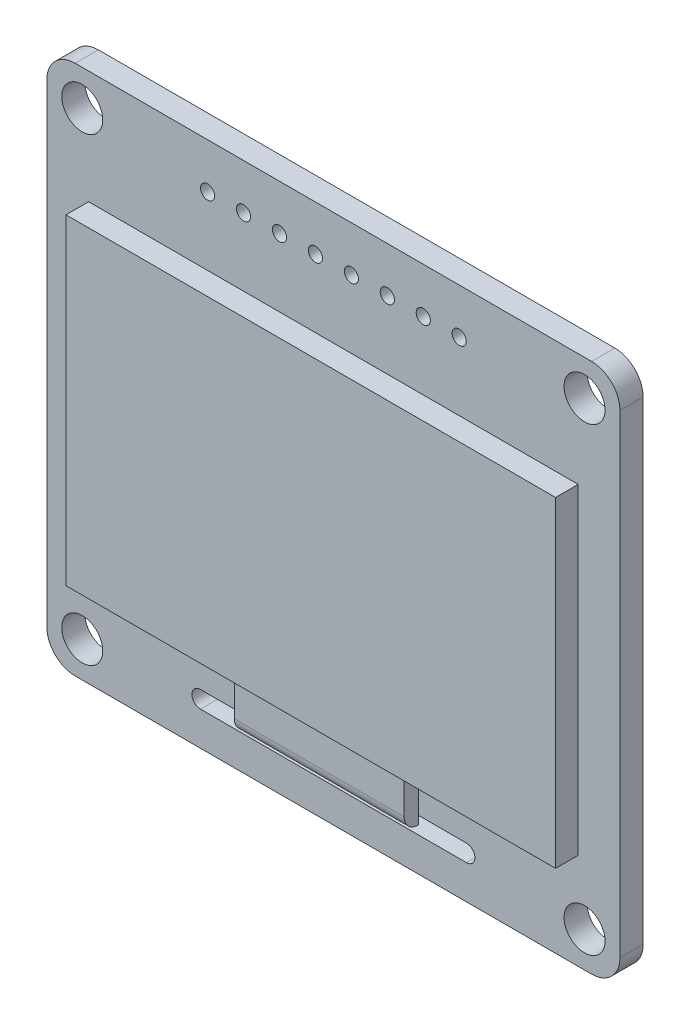
ISO-10303-21;
HEADER;
FILE_DESCRIPTION(('STEP AP214'),'2;1');
FILE_NAME('part.step','',(''),(''),'','','');
FILE_SCHEMA(('AUTOMOTIVE_DESIGN { 1 0 10303 214 1 1 1 1 }'));
ENDSEC;
DATA;
#1=APPLICATION_CONTEXT('core data for automotive mechanical design processes');
#2=APPLICATION_PROTOCOL_DEFINITION('international standard','automotive_design',2000,#1);
#3=PRODUCT_CONTEXT('',#1,'mechanical');
#4=PRODUCT('Part','Part','',(#3));
#5=PRODUCT_RELATED_PRODUCT_CATEGORY('part','',(#4));
#6=PRODUCT_DEFINITION_FORMATION('','',#4);
#7=PRODUCT_DEFINITION_CONTEXT('part definition',#1,'design');
#8=PRODUCT_DEFINITION('design','',#6,#7);
#9=PRODUCT_DEFINITION_SHAPE('','',#8);
#10=(LENGTH_UNIT() NAMED_UNIT(*) SI_UNIT(.MILLI.,.METRE.));
#11=(NAMED_UNIT(*) PLANE_ANGLE_UNIT() SI_UNIT($,.RADIAN.));
#12=(NAMED_UNIT(*) SI_UNIT($,.STERADIAN.) SOLID_ANGLE_UNIT());
#13=UNCERTAINTY_MEASURE_WITH_UNIT(LENGTH_MEASURE(1.E-05),#10,'distance_accuracy_value','');
#14=(GEOMETRIC_REPRESENTATION_CONTEXT(3) GLOBAL_UNCERTAINTY_ASSIGNED_CONTEXT((#13)) GLOBAL_UNIT_ASSIGNED_CONTEXT((#10,
#11,#12)) REPRESENTATION_CONTEXT('',''));
#15=CARTESIAN_POINT('',(0.,0.,0.));
#16=DIRECTION('',(0.,0.,1.));
#17=DIRECTION('',(1.,0.,0.));
#18=AXIS2_PLACEMENT_3D('',#15,#16,#17);
#19=CARTESIAN_POINT('',(0.,0.,1.64));
#20=DIRECTION('',(0.,0.,1.));
#21=DIRECTION('',(1.,0.,0.));
#22=AXIS2_PLACEMENT_3D('',#19,#20,#21);
#23=PLANE('',#22);
#24=CARTESIAN_POINT('',(-6.35,15.55,1.64));
#25=DIRECTION('',(0.,0.,1.));
#26=DIRECTION('',(1.,0.,0.));
#27=AXIS2_PLACEMENT_3D('',#24,#25,#26);
#28=CIRCLE('',#27,0.500000000000001);
#29=CARTESIAN_POINT('',(-5.85,15.55,1.64));
#30=VERTEX_POINT('',#29);
#31=EDGE_CURVE('E232',#30,#30,#28,.T.);
#32=ORIENTED_EDGE('',*,*,#31,.F.);
#33=EDGE_LOOP('',(#32));
#34=FACE_BOUND('',#33,.T.);
#35=CARTESIAN_POINT('',(-3.81,15.55,1.64));
#36=DIRECTION('',(0.,0.,1.));
#37=DIRECTION('',(1.,0.,0.));
#38=AXIS2_PLACEMENT_3D('',#35,#36,#37);
#39=CIRCLE('',#38,0.5);
#40=CARTESIAN_POINT('',(-3.31,15.55,1.64));
#41=VERTEX_POINT('',#40);
#42=EDGE_CURVE('E240',#41,#41,#39,.T.);
#43=ORIENTED_EDGE('',*,*,#42,.F.);
#44=EDGE_LOOP('',(#43));
#45=FACE_BOUND('',#44,.T.);
#46=CARTESIAN_POINT('',(-1.27,15.55,1.64));
#47=DIRECTION('',(0.,0.,1.));
#48=DIRECTION('',(1.,0.,0.));
#49=AXIS2_PLACEMENT_3D('',#46,#47,#48);
#50=CIRCLE('',#49,0.5);
#51=CARTESIAN_POINT('',(-0.77,15.55,1.64));
#52=VERTEX_POINT('',#51);
#53=EDGE_CURVE('E246',#52,#52,#50,.T.);
#54=ORIENTED_EDGE('',*,*,#53,.F.);
#55=EDGE_LOOP('',(#54));
#56=FACE_BOUND('',#55,.T.);
#57=CARTESIAN_POINT('',(1.27,15.55,1.64));
#58=DIRECTION('',(0.,0.,1.));
#59=DIRECTION('',(1.,0.,0.));
#60=AXIS2_PLACEMENT_3D('',#57,#58,#59);
#61=CIRCLE('',#60,0.500000000000001);
#62=CARTESIAN_POINT('',(1.77,15.55,1.64));
#63=VERTEX_POINT('',#62);
#64=EDGE_CURVE('E252',#63,#63,#61,.T.);
#65=ORIENTED_EDGE('',*,*,#64,.F.);
#66=EDGE_LOOP('',(#65));
#67=FACE_BOUND('',#66,.T.);
#68=CARTESIAN_POINT('',(3.81,15.55,1.64));
#69=DIRECTION('',(0.,0.,1.));
#70=DIRECTION('',(1.,0.,0.));
#71=AXIS2_PLACEMENT_3D('',#68,#69,#70);
#72=CIRCLE('',#71,0.500000000000001);
#73=CARTESIAN_POINT('',(4.31,15.55,1.64));
#74=VERTEX_POINT('',#73);
#75=EDGE_CURVE('E258',#74,#74,#72,.T.);
#76=ORIENTED_EDGE('',*,*,#75,.F.);
#77=EDGE_LOOP('',(#76));
#78=FACE_BOUND('',#77,.T.);
#79=CARTESIAN_POINT('',(6.35,15.55,1.64));
#80=DIRECTION('',(0.,0.,1.));
#81=DIRECTION('',(1.,0.,0.));
#82=AXIS2_PLACEMENT_3D('',#79,#80,#81);
#83=CIRCLE('',#82,0.500000000000001);
#84=CARTESIAN_POINT('',(6.85,15.55,1.64));
#85=VERTEX_POINT('',#84);
#86=EDGE_CURVE('E264',#85,#85,#83,.T.);
#87=ORIENTED_EDGE('',*,*,#86,.F.);
#88=EDGE_LOOP('',(#87));
#89=FACE_BOUND('',#88,.T.);
#90=CARTESIAN_POINT('',(8.89,15.55,1.64));
#91=DIRECTION('',(0.,0.,1.));
#92=DIRECTION('',(1.,0.,0.));
#93=AXIS2_PLACEMENT_3D('',#90,#91,#92);
#94=CIRCLE('',#93,0.499999999999999);
#95=CARTESIAN_POINT('',(9.39,15.55,1.64));
#96=VERTEX_POINT('',#95);
#97=EDGE_CURVE('E231',#96,#96,#94,.T.);
#98=ORIENTED_EDGE('',*,*,#97,.F.);
#99=EDGE_LOOP('',(#98));
#100=FACE_BOUND('',#99,.T.);
#101=CARTESIAN_POINT('',(-8.89,15.55,1.64));
#102=DIRECTION('',(0.,0.,1.));
#103=DIRECTION('',(1.,0.,0.));
#104=AXIS2_PLACEMENT_3D('',#101,#102,#103);
#105=CIRCLE('',#104,0.500000000000001);
#106=CARTESIAN_POINT('',(-8.39,15.55,1.64));
#107=VERTEX_POINT('',#106);
#108=EDGE_CURVE('E239',#107,#107,#105,.T.);
#109=ORIENTED_EDGE('',*,*,#108,.F.);
#110=EDGE_LOOP('',(#109));
#111=FACE_BOUND('',#110,.T.);
#112=CARTESIAN_POINT('',(17.75,16.25,1.64));
#113=DIRECTION('',(0.,0.,1.));
#114=DIRECTION('',(1.,0.,0.));
#115=AXIS2_PLACEMENT_3D('',#112,#113,#114);
#116=CIRCLE('',#115,1.45);
#117=CARTESIAN_POINT('',(19.2,16.25,1.64));
#118=VERTEX_POINT('',#117);
#119=EDGE_CURVE('E313',#118,#118,#116,.T.);
#120=ORIENTED_EDGE('',*,*,#119,.F.);
#121=EDGE_LOOP('',(#120));
#122=FACE_BOUND('',#121,.T.);
#123=CARTESIAN_POINT('',(17.7500000000003,-16.25,1.64));
#124=DIRECTION('',(0.,0.,1.));
#125=DIRECTION('',(1.,0.,0.));
#126=AXIS2_PLACEMENT_3D('',#123,#124,#125);
#127=CIRCLE('',#126,1.45);
#128=CARTESIAN_POINT('',(19.2000000000003,-16.25,1.64));
#129=VERTEX_POINT('',#128);
#130=EDGE_CURVE('E321',#129,#129,#127,.T.);
#131=ORIENTED_EDGE('',*,*,#130,.F.);
#132=EDGE_LOOP('',(#131));
#133=FACE_BOUND('',#132,.T.);
#134=CARTESIAN_POINT('',(-17.7499999999997,-16.25,1.64));
#135=DIRECTION('',(0.,0.,1.));
#136=DIRECTION('',(1.,0.,0.));
#137=AXIS2_PLACEMENT_3D('',#134,#135,#136);
#138=CIRCLE('',#137,1.45);
#139=CARTESIAN_POINT('',(-16.2999999999997,-16.25,1.64));
#140=VERTEX_POINT('',#139);
#141=EDGE_CURVE('E312',#140,#140,#138,.T.);
#142=ORIENTED_EDGE('',*,*,#141,.F.);
#143=EDGE_LOOP('',(#142));
#144=FACE_BOUND('',#143,.T.);
#145=CARTESIAN_POINT('',(-17.75,16.25,1.64));
#146=DIRECTION('',(0.,0.,1.));
#147=DIRECTION('',(1.,0.,0.));
#148=AXIS2_PLACEMENT_3D('',#145,#146,#147);
#149=CIRCLE('',#148,1.45);
#150=CARTESIAN_POINT('',(-16.3,16.25,1.64));
#151=VERTEX_POINT('',#150);
#152=EDGE_CURVE('E320',#151,#151,#149,.T.);
#153=ORIENTED_EDGE('',*,*,#152,.F.);
#154=EDGE_LOOP('',(#153));
#155=FACE_BOUND('',#154,.T.);
#156=DIRECTION('',(0.,-1.,0.));
#157=VECTOR('',#156,1.);
#158=CARTESIAN_POINT('',(-20.25,18.75,1.64));
#159=LINE('',#158,#157);
#160=CARTESIAN_POINT('',(-20.25,16.75,1.64));
#161=VERTEX_POINT('',#160);
#162=CARTESIAN_POINT('',(-20.25,-16.75,1.64));
#163=VERTEX_POINT('',#162);
#164=EDGE_CURVE('E337',#161,#163,#159,.T.);
#165=ORIENTED_EDGE('',*,*,#164,.T.);
#166=CARTESIAN_POINT('',(-18.25,-16.75,1.64));
#167=DIRECTION('',(0.,0.,1.));
#168=DIRECTION('',(1.,0.,0.));
#169=AXIS2_PLACEMENT_3D('',#166,#167,#168);
#170=CIRCLE('',#169,2.);
#171=CARTESIAN_POINT('',(-18.25,-18.75,1.64));
#172=VERTEX_POINT('',#171);
#173=EDGE_CURVE('E384',#163,#172,#170,.T.);
#174=ORIENTED_EDGE('',*,*,#173,.T.);
#175=DIRECTION('',(1.,0.,0.));
#176=VECTOR('',#175,1.);
#177=CARTESIAN_POINT('',(-20.25,-18.75,1.64));
#178=LINE('',#177,#176);
#179=CARTESIAN_POINT('',(18.25,-18.75,1.64));
#180=VERTEX_POINT('',#179);
#181=EDGE_CURVE('E340',#172,#180,#178,.T.);
#182=ORIENTED_EDGE('',*,*,#181,.T.);
#183=CARTESIAN_POINT('',(18.25,-16.75,1.64));
#184=DIRECTION('',(0.,0.,1.));
#185=DIRECTION('',(1.,0.,0.));
#186=AXIS2_PLACEMENT_3D('',#183,#184,#185);
#187=CIRCLE('',#186,2.);
#188=CARTESIAN_POINT('',(20.25,-16.75,1.64));
#189=VERTEX_POINT('',#188);
#190=EDGE_CURVE('E382',#180,#189,#187,.T.);
#191=ORIENTED_EDGE('',*,*,#190,.T.);
#192=DIRECTION('',(0.,1.,0.));
#193=VECTOR('',#192,1.);
#194=CARTESIAN_POINT('',(20.25,18.75,1.64));
#195=LINE('',#194,#193);
#196=CARTESIAN_POINT('',(20.25,16.75,1.64));
#197=VERTEX_POINT('',#196);
#198=EDGE_CURVE('E344',#189,#197,#195,.T.);
#199=ORIENTED_EDGE('',*,*,#198,.T.);
#200=CARTESIAN_POINT('',(18.25,16.75,1.64));
#201=DIRECTION('',(0.,0.,1.));
#202=DIRECTION('',(1.,0.,0.));
#203=AXIS2_PLACEMENT_3D('',#200,#201,#202);
#204=CIRCLE('',#203,2.);
#205=CARTESIAN_POINT('',(18.25,18.75,1.64));
#206=VERTEX_POINT('',#205);
#207=EDGE_CURVE('E380',#197,#206,#204,.T.);
#208=ORIENTED_EDGE('',*,*,#207,.T.);
#209=DIRECTION('',(-1.,0.,0.));
#210=VECTOR('',#209,1.);
#211=CARTESIAN_POINT('',(-20.25,18.75,1.64));
#212=LINE('',#211,#210);
#213=CARTESIAN_POINT('',(-18.25,18.75,1.64));
#214=VERTEX_POINT('',#213);
#215=EDGE_CURVE('E347',#206,#214,#212,.T.);
#216=ORIENTED_EDGE('',*,*,#215,.T.);
#217=CARTESIAN_POINT('',(-18.25,16.75,1.64));
#218=DIRECTION('',(0.,0.,1.));
#219=DIRECTION('',(1.,0.,0.));
#220=AXIS2_PLACEMENT_3D('',#217,#218,#219);
#221=CIRCLE('',#220,2.);
#222=EDGE_CURVE('E378',#214,#161,#221,.T.);
#223=ORIENTED_EDGE('',*,*,#222,.T.);
#224=EDGE_LOOP('',(#165,#174,#182,#191,#199,#208,#216,#223));
#225=FACE_BOUND('',#224,.T.);
#226=DIRECTION('',(-1.,0.,0.));
#227=VECTOR('',#226,1.);
#228=CARTESIAN_POINT('',(-9.4,-15.15,1.64));
#229=LINE('',#228,#227);
#230=CARTESIAN_POINT('',(-6.,-15.15,1.64));
#231=VERTEX_POINT('',#230);
#232=CARTESIAN_POINT('',(-9.4,-15.15,1.64));
#233=VERTEX_POINT('',#232);
#234=EDGE_CURVE('E295',#231,#233,#229,.T.);
#235=ORIENTED_EDGE('',*,*,#234,.F.);
#236=DIRECTION('',(0.,-1.,0.));
#237=VECTOR('',#236,1.);
#238=CARTESIAN_POINT('',(-6.,-11.95,1.64));
#239=LINE('',#238,#237);
#240=CARTESIAN_POINT('',(-6.,-11.95,1.64));
#241=VERTEX_POINT('',#240);
#242=EDGE_CURVE('E408',#241,#231,#239,.T.);
#243=ORIENTED_EDGE('',*,*,#242,.F.);
#244=DIRECTION('',(1.,0.,0.));
#245=VECTOR('',#244,1.);
#246=CARTESIAN_POINT('',(-17.3,-11.95,1.64));
#247=LINE('',#246,#245);
#248=CARTESIAN_POINT('',(-17.3,-11.95,1.64));
#249=VERTEX_POINT('',#248);
#250=EDGE_CURVE('E193',#249,#241,#247,.T.);
#251=ORIENTED_EDGE('',*,*,#250,.F.);
#252=DIRECTION('',(0.,-1.,0.));
#253=VECTOR('',#252,1.);
#254=CARTESIAN_POINT('',(-17.3,10.75,1.64));
#255=LINE('',#254,#253);
#256=CARTESIAN_POINT('',(-17.3,10.75,1.64));
#257=VERTEX_POINT('',#256);
#258=EDGE_CURVE('E202',#257,#249,#255,.T.);
#259=ORIENTED_EDGE('',*,*,#258,.F.);
#260=DIRECTION('',(-1.,0.,0.));
#261=VECTOR('',#260,1.);
#262=CARTESIAN_POINT('',(-17.3,10.75,1.64));
#263=LINE('',#262,#261);
#264=CARTESIAN_POINT('',(17.3,10.75,1.64));
#265=VERTEX_POINT('',#264);
#266=EDGE_CURVE('E207',#265,#257,#263,.T.);
#267=ORIENTED_EDGE('',*,*,#266,.F.);
#268=DIRECTION('',(0.,1.,0.));
#269=VECTOR('',#268,1.);
#270=CARTESIAN_POINT('',(17.3,10.75,1.64));
#271=LINE('',#270,#269);
#272=CARTESIAN_POINT('',(17.3,-11.95,1.64));
#273=VERTEX_POINT('',#272);
#274=EDGE_CURVE('E218',#273,#265,#271,.T.);
#275=ORIENTED_EDGE('',*,*,#274,.F.);
#276=CARTESIAN_POINT('',(6.,-11.95,1.64));
#277=VERTEX_POINT('',#276);
#278=EDGE_CURVE('E216',#277,#273,#247,.T.);
#279=ORIENTED_EDGE('',*,*,#278,.F.);
#280=DIRECTION('',(0.,1.,0.));
#281=VECTOR('',#280,1.);
#282=CARTESIAN_POINT('',(6.,-11.95,1.64));
#283=LINE('',#282,#281);
#284=CARTESIAN_POINT('',(6.,-15.15,1.64));
#285=VERTEX_POINT('',#284);
#286=EDGE_CURVE('E407',#285,#277,#283,.T.);
#287=ORIENTED_EDGE('',*,*,#286,.F.);
#288=CARTESIAN_POINT('',(9.4,-15.15,1.64));
#289=VERTEX_POINT('',#288);
#290=EDGE_CURVE('E296',#289,#285,#229,.T.);
#291=ORIENTED_EDGE('',*,*,#290,.F.);
#292=CARTESIAN_POINT('',(9.4,-15.75,1.64));
#293=DIRECTION('',(0.,0.,1.));
#294=DIRECTION('',(1.,0.,0.));
#295=AXIS2_PLACEMENT_3D('',#292,#293,#294);
#296=CIRCLE('',#295,0.599999999999999);
#297=CARTESIAN_POINT('',(9.4,-16.35,1.64));
#298=VERTEX_POINT('',#297);
#299=EDGE_CURVE('E292',#298,#289,#296,.T.);
#300=ORIENTED_EDGE('',*,*,#299,.F.);
#301=DIRECTION('',(1.,0.,0.));
#302=VECTOR('',#301,1.);
#303=CARTESIAN_POINT('',(-9.4,-16.35,1.64));
#304=LINE('',#303,#302);
#305=CARTESIAN_POINT('',(-9.4,-16.35,1.64));
#306=VERTEX_POINT('',#305);
#307=EDGE_CURVE('E289',#306,#298,#304,.T.);
#308=ORIENTED_EDGE('',*,*,#307,.F.);
#309=CARTESIAN_POINT('',(-9.4,-15.75,1.64));
#310=DIRECTION('',(0.,0.,1.));
#311=DIRECTION('',(1.,0.,0.));
#312=AXIS2_PLACEMENT_3D('',#309,#310,#311);
#313=CIRCLE('',#312,0.6);
#314=EDGE_CURVE('E287',#233,#306,#313,.T.);
#315=ORIENTED_EDGE('',*,*,#314,.F.);
#316=EDGE_LOOP('',(#235,#243,#251,#259,#267,#275,#279,#287,#291,#300,#308,#315));
#317=FACE_BOUND('',#316,.T.);
#318=ADVANCED_FACE('F33',(#34,#45,#56,#67,#78,#89,#100,#111,#122,#133,#144,#155,#225,#317),#23,.T.);
#319=CARTESIAN_POINT('',(-17.3,-11.95,3.24));
#320=DIRECTION('',(0.,1.,0.));
#321=DIRECTION('',(0.,0.,1.));
#322=AXIS2_PLACEMENT_3D('',#319,#320,#321);
#323=PLANE('',#322);
#324=DIRECTION('',(0.,0.,-1.));
#325=VECTOR('',#324,1.);
#326=CARTESIAN_POINT('',(-6.,-11.95,2.64));
#327=LINE('',#326,#325);
#328=CARTESIAN_POINT('',(-6.,-11.95,2.64));
#329=VERTEX_POINT('',#328);
#330=EDGE_CURVE('E183',#329,#241,#327,.T.);
#331=ORIENTED_EDGE('',*,*,#330,.F.);
#332=DIRECTION('',(-1.,0.,0.));
#333=VECTOR('',#332,1.);
#334=CARTESIAN_POINT('',(-6.,-11.95,2.64));
#335=LINE('',#334,#333);
#336=CARTESIAN_POINT('',(6.,-11.95,2.64));
#337=VERTEX_POINT('',#336);
#338=EDGE_CURVE('E174',#337,#329,#335,.T.);
#339=ORIENTED_EDGE('',*,*,#338,.F.);
#340=DIRECTION('',(0.,0.,-1.));
#341=VECTOR('',#340,1.);
#342=CARTESIAN_POINT('',(6.,-11.95,2.64));
#343=LINE('',#342,#341);
#344=EDGE_CURVE('E194',#337,#277,#343,.T.);
#345=ORIENTED_EDGE('',*,*,#344,.T.);
#346=ORIENTED_EDGE('',*,*,#278,.T.);
#347=DIRECTION('',(0.,0.,-1.));
#348=VECTOR('',#347,1.);
#349=CARTESIAN_POINT('',(17.3,-11.95,3.24));
#350=LINE('',#349,#348);
#351=CARTESIAN_POINT('',(17.3,-11.95,3.24));
#352=VERTEX_POINT('',#351);
#353=EDGE_CURVE('E226',#352,#273,#350,.T.);
#354=ORIENTED_EDGE('',*,*,#353,.F.);
#355=DIRECTION('',(1.,0.,0.));
#356=VECTOR('',#355,1.);
#357=CARTESIAN_POINT('',(-17.3,-11.95,3.24));
#358=LINE('',#357,#356);
#359=CARTESIAN_POINT('',(-17.3,-11.95,3.24));
#360=VERTEX_POINT('',#359);
#361=EDGE_CURVE('E206',#360,#352,#358,.T.);
#362=ORIENTED_EDGE('',*,*,#361,.F.);
#363=DIRECTION('',(0.,0.,-1.));
#364=VECTOR('',#363,1.);
#365=CARTESIAN_POINT('',(-17.3,-11.95,3.24));
#366=LINE('',#365,#364);
#367=EDGE_CURVE('E229',#360,#249,#366,.T.);
#368=ORIENTED_EDGE('',*,*,#367,.T.);
#369=ORIENTED_EDGE('',*,*,#250,.T.);
#370=EDGE_LOOP('',(#331,#339,#345,#346,#354,#362,#368,#369));
#371=FACE_BOUND('',#370,.T.);
#372=ADVANCED_FACE('F191',(#371),#323,.F.);
#373=CARTESIAN_POINT('',(-20.25,18.75,1.64));
#374=DIRECTION('',(1.,0.,0.));
#375=DIRECTION('',(0.,1.,0.));
#376=AXIS2_PLACEMENT_3D('',#373,#374,#375);
#377=PLANE('',#376);
#378=DIRECTION('',(0.,-1.,0.));
#379=VECTOR('',#378,1.);
#380=CARTESIAN_POINT('',(-20.25,18.75,0.));
#381=LINE('',#380,#379);
#382=CARTESIAN_POINT('',(-20.25,16.75,0.));
#383=VERTEX_POINT('',#382);
#384=CARTESIAN_POINT('',(-20.25,-16.75,0.));
#385=VERTEX_POINT('',#384);
#386=EDGE_CURVE('E336',#383,#385,#381,.T.);
#387=ORIENTED_EDGE('',*,*,#386,.T.);
#388=DIRECTION('',(0.,0.,-1.));
#389=VECTOR('',#388,1.);
#390=CARTESIAN_POINT('',(-20.25,-16.75,1.64));
#391=LINE('',#390,#389);
#392=EDGE_CURVE('E376',#385,#163,#391,.F.);
#393=ORIENTED_EDGE('',*,*,#392,.T.);
#394=ORIENTED_EDGE('',*,*,#164,.F.);
#395=DIRECTION('',(0.,0.,-1.));
#396=VECTOR('',#395,1.);
#397=CARTESIAN_POINT('',(-20.25,16.75,1.64));
#398=LINE('',#397,#396);
#399=EDGE_CURVE('E373',#161,#383,#398,.T.);
#400=ORIENTED_EDGE('',*,*,#399,.T.);
#401=EDGE_LOOP('',(#387,#393,#394,#400));
#402=FACE_BOUND('',#401,.T.);
#403=ADVANCED_FACE('F454',(#402),#377,.F.);
#404=CARTESIAN_POINT('',(-20.25,-18.75,1.64));
#405=DIRECTION('',(0.,1.,0.));
#406=DIRECTION('',(0.,0.,1.));
#407=AXIS2_PLACEMENT_3D('',#404,#405,#406);
#408=PLANE('',#407);
#409=ORIENTED_EDGE('',*,*,#181,.F.);
#410=DIRECTION('',(0.,0.,-1.));
#411=VECTOR('',#410,1.);
#412=CARTESIAN_POINT('',(-18.25,-18.75,1.64));
#413=LINE('',#412,#411);
#414=CARTESIAN_POINT('',(-18.25,-18.75,0.));
#415=VERTEX_POINT('',#414);
#416=EDGE_CURVE('E362',#172,#415,#413,.T.);
#417=ORIENTED_EDGE('',*,*,#416,.T.);
#418=DIRECTION('',(1.,0.,0.));
#419=VECTOR('',#418,1.);
#420=CARTESIAN_POINT('',(-20.25,-18.75,0.));
#421=LINE('',#420,#419);
#422=CARTESIAN_POINT('',(18.25,-18.75,0.));
#423=VERTEX_POINT('',#422);
#424=EDGE_CURVE('E353',#415,#423,#421,.T.);
#425=ORIENTED_EDGE('',*,*,#424,.T.);
#426=DIRECTION('',(0.,0.,-1.));
#427=VECTOR('',#426,1.);
#428=CARTESIAN_POINT('',(18.25,-18.75,1.64));
#429=LINE('',#428,#427);
#430=EDGE_CURVE('E350',#423,#180,#429,.F.);
#431=ORIENTED_EDGE('',*,*,#430,.T.);
#432=EDGE_LOOP('',(#409,#417,#425,#431));
#433=FACE_BOUND('',#432,.T.);
#434=ADVANCED_FACE('F474',(#433),#408,.F.);
#435=CARTESIAN_POINT('',(20.25,18.75,1.64));
#436=DIRECTION('',(-1.,0.,0.));
#437=DIRECTION('',(0.,-1.,0.));
#438=AXIS2_PLACEMENT_3D('',#435,#436,#437);
#439=PLANE('',#438);
#440=ORIENTED_EDGE('',*,*,#198,.F.);
#441=DIRECTION('',(0.,0.,-1.));
#442=VECTOR('',#441,1.);
#443=CARTESIAN_POINT('',(20.25,-16.75,1.64));
#444=LINE('',#443,#442);
#445=CARTESIAN_POINT('',(20.25,-16.75,0.));
#446=VERTEX_POINT('',#445);
#447=EDGE_CURVE('E388',#189,#446,#444,.T.);
#448=ORIENTED_EDGE('',*,*,#447,.T.);
#449=DIRECTION('',(0.,1.,0.));
#450=VECTOR('',#449,1.);
#451=CARTESIAN_POINT('',(20.25,18.75,0.));
#452=LINE('',#451,#450);
#453=CARTESIAN_POINT('',(20.25,16.75,0.));
#454=VERTEX_POINT('',#453);
#455=EDGE_CURVE('E356',#446,#454,#452,.T.);
#456=ORIENTED_EDGE('',*,*,#455,.T.);
#457=DIRECTION('',(0.,0.,-1.));
#458=VECTOR('',#457,1.);
#459=CARTESIAN_POINT('',(20.25,16.75,1.64));
#460=LINE('',#459,#458);
#461=EDGE_CURVE('E386',#454,#197,#460,.F.);
#462=ORIENTED_EDGE('',*,*,#461,.T.);
#463=EDGE_LOOP('',(#440,#448,#456,#462));
#464=FACE_BOUND('',#463,.T.);
#465=ADVANCED_FACE('F470',(#464),#439,.F.);
#466=CARTESIAN_POINT('',(-20.25,18.75,1.64));
#467=DIRECTION('',(0.,-1.,0.));
#468=DIRECTION('',(0.,0.,-1.));
#469=AXIS2_PLACEMENT_3D('',#466,#467,#468);
#470=PLANE('',#469);
#471=ORIENTED_EDGE('',*,*,#215,.F.);
#472=DIRECTION('',(0.,0.,-1.));
#473=VECTOR('',#472,1.);
#474=CARTESIAN_POINT('',(18.25,18.75,1.64));
#475=LINE('',#474,#473);
#476=CARTESIAN_POINT('',(18.25,18.75,0.));
#477=VERTEX_POINT('',#476);
#478=EDGE_CURVE('E393',#206,#477,#475,.T.);
#479=ORIENTED_EDGE('',*,*,#478,.T.);
#480=DIRECTION('',(-1.,0.,0.));
#481=VECTOR('',#480,1.);
#482=CARTESIAN_POINT('',(-20.25,18.75,0.));
#483=LINE('',#482,#481);
#484=CARTESIAN_POINT('',(-18.25,18.75,0.));
#485=VERTEX_POINT('',#484);
#486=EDGE_CURVE('E341',#477,#485,#483,.T.);
#487=ORIENTED_EDGE('',*,*,#486,.T.);
#488=DIRECTION('',(0.,0.,-1.));
#489=VECTOR('',#488,1.);
#490=CARTESIAN_POINT('',(-18.25,18.75,1.64));
#491=LINE('',#490,#489);
#492=EDGE_CURVE('E391',#485,#214,#491,.F.);
#493=ORIENTED_EDGE('',*,*,#492,.T.);
#494=EDGE_LOOP('',(#471,#479,#487,#493));
#495=FACE_BOUND('',#494,.T.);
#496=ADVANCED_FACE('F466',(#495),#470,.F.);
#497=CARTESIAN_POINT('',(0.,0.,0.));
#498=DIRECTION('',(0.,0.,1.));
#499=DIRECTION('',(1.,0.,0.));
#500=AXIS2_PLACEMENT_3D('',#497,#498,#499);
#501=PLANE('',#500);
#502=CARTESIAN_POINT('',(-6.35,15.55,0.));
#503=DIRECTION('',(0.,0.,1.));
#504=DIRECTION('',(1.,0.,0.));
#505=AXIS2_PLACEMENT_3D('',#502,#503,#504);
#506=CIRCLE('',#505,0.500000000000001);
#507=CARTESIAN_POINT('',(-5.85,15.55,0.));
#508=VERTEX_POINT('',#507);
#509=EDGE_CURVE('E235',#508,#508,#506,.F.);
#510=ORIENTED_EDGE('',*,*,#509,.F.);
#511=EDGE_LOOP('',(#510));
#512=FACE_BOUND('',#511,.T.);
#513=CARTESIAN_POINT('',(-3.81,15.55,0.));
#514=DIRECTION('',(0.,0.,1.));
#515=DIRECTION('',(1.,0.,0.));
#516=AXIS2_PLACEMENT_3D('',#513,#514,#515);
#517=CIRCLE('',#516,0.5);
#518=CARTESIAN_POINT('',(-3.31,15.55,0.));
#519=VERTEX_POINT('',#518);
#520=EDGE_CURVE('E236',#519,#519,#517,.F.);
#521=ORIENTED_EDGE('',*,*,#520,.F.);
#522=EDGE_LOOP('',(#521));
#523=FACE_BOUND('',#522,.T.);
#524=CARTESIAN_POINT('',(-1.27,15.55,0.));
#525=DIRECTION('',(0.,0.,1.));
#526=DIRECTION('',(1.,0.,0.));
#527=AXIS2_PLACEMENT_3D('',#524,#525,#526);
#528=CIRCLE('',#527,0.5);
#529=CARTESIAN_POINT('',(-0.77,15.55,0.));
#530=VERTEX_POINT('',#529);
#531=EDGE_CURVE('E243',#530,#530,#528,.F.);
#532=ORIENTED_EDGE('',*,*,#531,.F.);
#533=EDGE_LOOP('',(#532));
#534=FACE_BOUND('',#533,.T.);
#535=CARTESIAN_POINT('',(1.27,15.55,0.));
#536=DIRECTION('',(0.,0.,1.));
#537=DIRECTION('',(1.,0.,0.));
#538=AXIS2_PLACEMENT_3D('',#535,#536,#537);
#539=CIRCLE('',#538,0.500000000000001);
#540=CARTESIAN_POINT('',(1.77,15.55,0.));
#541=VERTEX_POINT('',#540);
#542=EDGE_CURVE('E249',#541,#541,#539,.F.);
#543=ORIENTED_EDGE('',*,*,#542,.F.);
#544=EDGE_LOOP('',(#543));
#545=FACE_BOUND('',#544,.T.);
#546=CARTESIAN_POINT('',(3.81,15.55,0.));
#547=DIRECTION('',(0.,0.,1.));
#548=DIRECTION('',(1.,0.,0.));
#549=AXIS2_PLACEMENT_3D('',#546,#547,#548);
#550=CIRCLE('',#549,0.500000000000001);
#551=CARTESIAN_POINT('',(4.31,15.55,0.));
#552=VERTEX_POINT('',#551);
#553=EDGE_CURVE('E255',#552,#552,#550,.F.);
#554=ORIENTED_EDGE('',*,*,#553,.F.);
#555=EDGE_LOOP('',(#554));
#556=FACE_BOUND('',#555,.T.);
#557=CARTESIAN_POINT('',(6.35,15.55,0.));
#558=DIRECTION('',(0.,0.,1.));
#559=DIRECTION('',(1.,0.,0.));
#560=AXIS2_PLACEMENT_3D('',#557,#558,#559);
#561=CIRCLE('',#560,0.500000000000001);
#562=CARTESIAN_POINT('',(6.85,15.55,0.));
#563=VERTEX_POINT('',#562);
#564=EDGE_CURVE('E261',#563,#563,#561,.F.);
#565=ORIENTED_EDGE('',*,*,#564,.F.);
#566=EDGE_LOOP('',(#565));
#567=FACE_BOUND('',#566,.T.);
#568=CARTESIAN_POINT('',(8.89,15.55,0.));
#569=DIRECTION('',(0.,0.,1.));
#570=DIRECTION('',(1.,0.,0.));
#571=AXIS2_PLACEMENT_3D('',#568,#569,#570);
#572=CIRCLE('',#571,0.499999999999999);
#573=CARTESIAN_POINT('',(9.39,15.55,0.));
#574=VERTEX_POINT('',#573);
#575=EDGE_CURVE('E267',#574,#574,#572,.F.);
#576=ORIENTED_EDGE('',*,*,#575,.F.);
#577=EDGE_LOOP('',(#576));
#578=FACE_BOUND('',#577,.T.);
#579=CARTESIAN_POINT('',(-8.89,15.55,0.));
#580=DIRECTION('',(0.,0.,1.));
#581=DIRECTION('',(1.,0.,0.));
#582=AXIS2_PLACEMENT_3D('',#579,#580,#581);
#583=CIRCLE('',#582,0.500000000000001);
#584=CARTESIAN_POINT('',(-8.39,15.55,0.));
#585=VERTEX_POINT('',#584);
#586=EDGE_CURVE('E276',#585,#585,#583,.F.);
#587=ORIENTED_EDGE('',*,*,#586,.F.);
#588=EDGE_LOOP('',(#587));
#589=FACE_BOUND('',#588,.T.);
#590=DIRECTION('',(1.,0.,0.));
#591=VECTOR('',#590,1.);
#592=CARTESIAN_POINT('',(-9.4,-15.15,0.));
#593=LINE('',#592,#591);
#594=CARTESIAN_POINT('',(-9.4,-15.15,0.));
#595=VERTEX_POINT('',#594);
#596=CARTESIAN_POINT('',(9.4,-15.15,0.));
#597=VERTEX_POINT('',#596);
#598=EDGE_CURVE('E281',#595,#597,#593,.T.);
#599=ORIENTED_EDGE('',*,*,#598,.F.);
#600=CARTESIAN_POINT('',(-9.4,-15.75,0.));
#601=DIRECTION('',(0.,0.,1.));
#602=DIRECTION('',(1.,0.,0.));
#603=AXIS2_PLACEMENT_3D('',#600,#601,#602);
#604=CIRCLE('',#603,0.6);
#605=CARTESIAN_POINT('',(-9.4,-16.35,0.));
#606=VERTEX_POINT('',#605);
#607=EDGE_CURVE('E284',#606,#595,#604,.F.);
#608=ORIENTED_EDGE('',*,*,#607,.F.);
#609=DIRECTION('',(-1.,0.,0.));
#610=VECTOR('',#609,1.);
#611=CARTESIAN_POINT('',(-9.4,-16.35,0.));
#612=LINE('',#611,#610);
#613=CARTESIAN_POINT('',(9.4,-16.35,0.));
#614=VERTEX_POINT('',#613);
#615=EDGE_CURVE('E303',#614,#606,#612,.T.);
#616=ORIENTED_EDGE('',*,*,#615,.F.);
#617=CARTESIAN_POINT('',(9.4,-15.75,0.));
#618=DIRECTION('',(0.,0.,1.));
#619=DIRECTION('',(1.,0.,0.));
#620=AXIS2_PLACEMENT_3D('',#617,#618,#619);
#621=CIRCLE('',#620,0.599999999999999);
#622=EDGE_CURVE('E279',#597,#614,#621,.F.);
#623=ORIENTED_EDGE('',*,*,#622,.F.);
#624=EDGE_LOOP('',(#599,#608,#616,#623));
#625=FACE_BOUND('',#624,.T.);
#626=CARTESIAN_POINT('',(17.75,16.25,0.));
#627=DIRECTION('',(0.,0.,1.));
#628=DIRECTION('',(1.,0.,0.));
#629=AXIS2_PLACEMENT_3D('',#626,#627,#628);
#630=CIRCLE('',#629,1.45);
#631=CARTESIAN_POINT('',(19.2,16.25,0.));
#632=VERTEX_POINT('',#631);
#633=EDGE_CURVE('E316',#632,#632,#630,.F.);
#634=ORIENTED_EDGE('',*,*,#633,.F.);
#635=EDGE_LOOP('',(#634));
#636=FACE_BOUND('',#635,.T.);
#637=CARTESIAN_POINT('',(17.7500000000003,-16.25,0.));
#638=DIRECTION('',(0.,0.,1.));
#639=DIRECTION('',(1.,0.,0.));
#640=AXIS2_PLACEMENT_3D('',#637,#638,#639);
#641=CIRCLE('',#640,1.45);
#642=CARTESIAN_POINT('',(19.2000000000003,-16.25,0.));
#643=VERTEX_POINT('',#642);
#644=EDGE_CURVE('E317',#643,#643,#641,.F.);
#645=ORIENTED_EDGE('',*,*,#644,.F.);
#646=EDGE_LOOP('',(#645));
#647=FACE_BOUND('',#646,.T.);
#648=CARTESIAN_POINT('',(-17.7499999999997,-16.25,0.));
#649=DIRECTION('',(0.,0.,1.));
#650=DIRECTION('',(1.,0.,0.));
#651=AXIS2_PLACEMENT_3D('',#648,#649,#650);
#652=CIRCLE('',#651,1.45);
#653=CARTESIAN_POINT('',(-16.2999999999997,-16.25,0.));
#654=VERTEX_POINT('',#653);
#655=EDGE_CURVE('E324',#654,#654,#652,.F.);
#656=ORIENTED_EDGE('',*,*,#655,.F.);
#657=EDGE_LOOP('',(#656));
#658=FACE_BOUND('',#657,.T.);
#659=CARTESIAN_POINT('',(-17.75,16.25,0.));
#660=DIRECTION('',(0.,0.,1.));
#661=DIRECTION('',(1.,0.,0.));
#662=AXIS2_PLACEMENT_3D('',#659,#660,#661);
#663=CIRCLE('',#662,1.45);
#664=CARTESIAN_POINT('',(-16.3,16.25,0.));
#665=VERTEX_POINT('',#664);
#666=EDGE_CURVE('E333',#665,#665,#663,.F.);
#667=ORIENTED_EDGE('',*,*,#666,.F.);
#668=EDGE_LOOP('',(#667));
#669=FACE_BOUND('',#668,.T.);
#670=ORIENTED_EDGE('',*,*,#424,.F.);
#671=CARTESIAN_POINT('',(-18.25,-16.75,0.));
#672=DIRECTION('',(0.,0.,1.));
#673=DIRECTION('',(1.,0.,0.));
#674=AXIS2_PLACEMENT_3D('',#671,#672,#673);
#675=CIRCLE('',#674,2.);
#676=EDGE_CURVE('E371',#415,#385,#675,.F.);
#677=ORIENTED_EDGE('',*,*,#676,.T.);
#678=ORIENTED_EDGE('',*,*,#386,.F.);
#679=CARTESIAN_POINT('',(-18.25,16.75,0.));
#680=DIRECTION('',(0.,0.,1.));
#681=DIRECTION('',(1.,0.,0.));
#682=AXIS2_PLACEMENT_3D('',#679,#680,#681);
#683=CIRCLE('',#682,2.);
#684=EDGE_CURVE('E365',#383,#485,#683,.F.);
#685=ORIENTED_EDGE('',*,*,#684,.T.);
#686=ORIENTED_EDGE('',*,*,#486,.F.);
#687=CARTESIAN_POINT('',(18.25,16.75,0.));
#688=DIRECTION('',(0.,0.,1.));
#689=DIRECTION('',(1.,0.,0.));
#690=AXIS2_PLACEMENT_3D('',#687,#688,#689);
#691=CIRCLE('',#690,2.);
#692=EDGE_CURVE('E367',#477,#454,#691,.F.);
#693=ORIENTED_EDGE('',*,*,#692,.T.);
#694=ORIENTED_EDGE('',*,*,#455,.F.);
#695=CARTESIAN_POINT('',(18.25,-16.75,0.));
#696=DIRECTION('',(0.,0.,1.));
#697=DIRECTION('',(1.,0.,0.));
#698=AXIS2_PLACEMENT_3D('',#695,#696,#697);
#699=CIRCLE('',#698,2.);
#700=EDGE_CURVE('E369',#446,#423,#699,.F.);
#701=ORIENTED_EDGE('',*,*,#700,.T.);
#702=EDGE_LOOP('',(#670,#677,#678,#685,#686,#693,#694,#701));
#703=FACE_BOUND('',#702,.T.);
#704=ADVANCED_FACE('F462',(#512,#523,#534,#545,#556,#567,#578,#589,#625,#636,#647,#658,#669,
#703),#501,.F.);
#705=CARTESIAN_POINT('',(-18.25,-16.75,1.64));
#706=DIRECTION('',(0.,0.,-1.));
#707=DIRECTION('',(-1.,0.,0.));
#708=AXIS2_PLACEMENT_3D('',#705,#706,#707);
#709=CYLINDRICAL_SURFACE('',#708,2.);
#710=ORIENTED_EDGE('',*,*,#173,.F.);
#711=ORIENTED_EDGE('',*,*,#392,.F.);
#712=ORIENTED_EDGE('',*,*,#676,.F.);
#713=ORIENTED_EDGE('',*,*,#416,.F.);
#714=EDGE_LOOP('',(#710,#711,#712,#713));
#715=FACE_BOUND('',#714,.T.);
#716=ADVANCED_FACE('F465',(#715),#709,.T.);
#717=CARTESIAN_POINT('',(18.25,-16.75,1.64));
#718=DIRECTION('',(0.,0.,-1.));
#719=DIRECTION('',(-1.,0.,0.));
#720=AXIS2_PLACEMENT_3D('',#717,#718,#719);
#721=CYLINDRICAL_SURFACE('',#720,2.);
#722=ORIENTED_EDGE('',*,*,#190,.F.);
#723=ORIENTED_EDGE('',*,*,#430,.F.);
#724=ORIENTED_EDGE('',*,*,#700,.F.);
#725=ORIENTED_EDGE('',*,*,#447,.F.);
#726=EDGE_LOOP('',(#722,#723,#724,#725));
#727=FACE_BOUND('',#726,.T.);
#728=ADVANCED_FACE('F484',(#727),#721,.T.);
#729=CARTESIAN_POINT('',(18.25,16.75,1.64));
#730=DIRECTION('',(0.,0.,-1.));
#731=DIRECTION('',(-1.,0.,0.));
#732=AXIS2_PLACEMENT_3D('',#729,#730,#731);
#733=CYLINDRICAL_SURFACE('',#732,2.);
#734=ORIENTED_EDGE('',*,*,#207,.F.);
#735=ORIENTED_EDGE('',*,*,#461,.F.);
#736=ORIENTED_EDGE('',*,*,#692,.F.);
#737=ORIENTED_EDGE('',*,*,#478,.F.);
#738=EDGE_LOOP('',(#734,#735,#736,#737));
#739=FACE_BOUND('',#738,.T.);
#740=ADVANCED_FACE('F488',(#739),#733,.T.);
#741=CARTESIAN_POINT('',(-18.25,16.75,1.64));
#742=DIRECTION('',(0.,0.,-1.));
#743=DIRECTION('',(-1.,0.,0.));
#744=AXIS2_PLACEMENT_3D('',#741,#742,#743);
#745=CYLINDRICAL_SURFACE('',#744,2.);
#746=ORIENTED_EDGE('',*,*,#222,.F.);
#747=ORIENTED_EDGE('',*,*,#492,.F.);
#748=ORIENTED_EDGE('',*,*,#684,.F.);
#749=ORIENTED_EDGE('',*,*,#399,.F.);
#750=EDGE_LOOP('',(#746,#747,#748,#749));
#751=FACE_BOUND('',#750,.T.);
#752=ADVANCED_FACE('F491',(#751),#745,.T.);
#753=CARTESIAN_POINT('',(-17.75,16.25,-0.000999999999999916));
#754=DIRECTION('',(0.,0.,1.));
#755=DIRECTION('',(1.,0.,0.));
#756=AXIS2_PLACEMENT_3D('',#753,#754,#755);
#757=CYLINDRICAL_SURFACE('',#756,1.45);
#758=ORIENTED_EDGE('',*,*,#152,.T.);
#759=EDGE_LOOP('',(#758));
#760=FACE_BOUND('',#759,.T.);
#761=ORIENTED_EDGE('',*,*,#666,.T.);
#762=EDGE_LOOP('',(#761));
#763=FACE_BOUND('',#762,.T.);
#764=ADVANCED_FACE('F460',(#760,#763),#757,.F.);
#765=CARTESIAN_POINT('',(-17.7499999999997,-16.25,-0.000999999999999916));
#766=DIRECTION('',(0.,0.,1.));
#767=DIRECTION('',(1.,0.,0.));
#768=AXIS2_PLACEMENT_3D('',#765,#766,#767);
#769=CYLINDRICAL_SURFACE('',#768,1.45);
#770=ORIENTED_EDGE('',*,*,#141,.T.);
#771=EDGE_LOOP('',(#770));
#772=FACE_BOUND('',#771,.T.);
#773=ORIENTED_EDGE('',*,*,#655,.T.);
#774=EDGE_LOOP('',(#773));
#775=FACE_BOUND('',#774,.T.);
#776=ADVANCED_FACE('F498',(#772,#775),#769,.F.);
#777=CARTESIAN_POINT('',(17.7500000000003,-16.25,-0.000999999999999916));
#778=DIRECTION('',(0.,0.,1.));
#779=DIRECTION('',(1.,0.,0.));
#780=AXIS2_PLACEMENT_3D('',#777,#778,#779);
#781=CYLINDRICAL_SURFACE('',#780,1.45);
#782=ORIENTED_EDGE('',*,*,#130,.T.);
#783=EDGE_LOOP('',(#782));
#784=FACE_BOUND('',#783,.T.);
#785=ORIENTED_EDGE('',*,*,#644,.T.);
#786=EDGE_LOOP('',(#785));
#787=FACE_BOUND('',#786,.T.);
#788=ADVANCED_FACE('F525',(#784,#787),#781,.F.);
#789=CARTESIAN_POINT('',(17.75,16.25,-0.000999999999999916));
#790=DIRECTION('',(0.,0.,1.));
#791=DIRECTION('',(1.,0.,0.));
#792=AXIS2_PLACEMENT_3D('',#789,#790,#791);
#793=CYLINDRICAL_SURFACE('',#792,1.45);
#794=ORIENTED_EDGE('',*,*,#119,.T.);
#795=EDGE_LOOP('',(#794));
#796=FACE_BOUND('',#795,.T.);
#797=ORIENTED_EDGE('',*,*,#633,.T.);
#798=EDGE_LOOP('',(#797));
#799=FACE_BOUND('',#798,.T.);
#800=ADVANCED_FACE('F535',(#796,#799),#793,.F.);
#801=CARTESIAN_POINT('',(-9.4,-15.75,-0.000999999999999916));
#802=DIRECTION('',(0.,0.,1.));
#803=DIRECTION('',(1.,0.,0.));
#804=AXIS2_PLACEMENT_3D('',#801,#802,#803);
#805=CYLINDRICAL_SURFACE('',#804,0.6);
#806=ORIENTED_EDGE('',*,*,#607,.T.);
#807=DIRECTION('',(0.,0.,1.));
#808=VECTOR('',#807,1.);
#809=CARTESIAN_POINT('',(-9.4,-15.15,-0.000999999999999916));
#810=LINE('',#809,#808);
#811=EDGE_CURVE('E300',#595,#233,#810,.T.);
#812=ORIENTED_EDGE('',*,*,#811,.T.);
#813=ORIENTED_EDGE('',*,*,#314,.T.);
#814=DIRECTION('',(0.,0.,1.));
#815=VECTOR('',#814,1.);
#816=CARTESIAN_POINT('',(-9.4,-16.35,-0.000999999999999916));
#817=LINE('',#816,#815);
#818=EDGE_CURVE('E299',#606,#306,#817,.T.);
#819=ORIENTED_EDGE('',*,*,#818,.F.);
#820=EDGE_LOOP('',(#806,#812,#813,#819));
#821=FACE_BOUND('',#820,.T.);
#822=ADVANCED_FACE('F542',(#821),#805,.F.);
#823=CARTESIAN_POINT('',(-9.4,-15.15,-0.000999999999999916));
#824=DIRECTION('',(0.,1.,0.));
#825=DIRECTION('',(-1.,0.,0.));
#826=AXIS2_PLACEMENT_3D('',#823,#824,#825);
#827=PLANE('',#826);
#828=ORIENTED_EDGE('',*,*,#598,.T.);
#829=DIRECTION('',(0.,0.,1.));
#830=VECTOR('',#829,1.);
#831=CARTESIAN_POINT('',(9.4,-15.15,-0.000999999999999916));
#832=LINE('',#831,#830);
#833=EDGE_CURVE('E304',#597,#289,#832,.T.);
#834=ORIENTED_EDGE('',*,*,#833,.T.);
#835=ORIENTED_EDGE('',*,*,#290,.T.);
#836=DIRECTION('',(1.,0.,0.));
#837=VECTOR('',#836,1.);
#838=CARTESIAN_POINT('',(-9.4,-15.15,1.64));
#839=LINE('',#838,#837);
#840=EDGE_CURVE('E196',#231,#285,#839,.T.);
#841=ORIENTED_EDGE('',*,*,#840,.F.);
#842=ORIENTED_EDGE('',*,*,#234,.T.);
#843=ORIENTED_EDGE('',*,*,#811,.F.);
#844=EDGE_LOOP('',(#828,#834,#835,#841,#842,#843));
#845=FACE_BOUND('',#844,.T.);
#846=ADVANCED_FACE('F417',(#845),#827,.F.);
#847=CARTESIAN_POINT('',(9.4,-15.75,-0.000999999999999916));
#848=DIRECTION('',(0.,0.,1.));
#849=DIRECTION('',(1.,0.,0.));
#850=AXIS2_PLACEMENT_3D('',#847,#848,#849);
#851=CYLINDRICAL_SURFACE('',#850,0.599999999999999);
#852=ORIENTED_EDGE('',*,*,#622,.T.);
#853=DIRECTION('',(0.,0.,1.));
#854=VECTOR('',#853,1.);
#855=CARTESIAN_POINT('',(9.4,-16.35,-0.000999999999999916));
#856=LINE('',#855,#854);
#857=EDGE_CURVE('E306',#614,#298,#856,.T.);
#858=ORIENTED_EDGE('',*,*,#857,.T.);
#859=ORIENTED_EDGE('',*,*,#299,.T.);
#860=ORIENTED_EDGE('',*,*,#833,.F.);
#861=EDGE_LOOP('',(#852,#858,#859,#860));
#862=FACE_BOUND('',#861,.T.);
#863=ADVANCED_FACE('F551',(#862),#851,.F.);
#864=CARTESIAN_POINT('',(-9.4,-16.35,-0.000999999999999916));
#865=DIRECTION('',(0.,-1.,0.));
#866=DIRECTION('',(1.,0.,0.));
#867=AXIS2_PLACEMENT_3D('',#864,#865,#866);
#868=PLANE('',#867);
#869=ORIENTED_EDGE('',*,*,#615,.T.);
#870=ORIENTED_EDGE('',*,*,#818,.T.);
#871=ORIENTED_EDGE('',*,*,#307,.T.);
#872=ORIENTED_EDGE('',*,*,#857,.F.);
#873=EDGE_LOOP('',(#869,#870,#871,#872));
#874=FACE_BOUND('',#873,.T.);
#875=ADVANCED_FACE('F547',(#874),#868,.F.);
#876=CARTESIAN_POINT('',(-8.89,15.55,-0.000999999999999916));
#877=DIRECTION('',(0.,0.,1.));
#878=DIRECTION('',(1.,0.,0.));
#879=AXIS2_PLACEMENT_3D('',#876,#877,#878);
#880=CYLINDRICAL_SURFACE('',#879,0.500000000000001);
#881=ORIENTED_EDGE('',*,*,#108,.T.);
#882=EDGE_LOOP('',(#881));
#883=FACE_BOUND('',#882,.T.);
#884=ORIENTED_EDGE('',*,*,#586,.T.);
#885=EDGE_LOOP('',(#884));
#886=FACE_BOUND('',#885,.T.);
#887=ADVANCED_FACE('F550',(#883,#886),#880,.F.);
#888=CARTESIAN_POINT('',(8.89,15.55,-0.000999999999999916));
#889=DIRECTION('',(0.,0.,1.));
#890=DIRECTION('',(1.,0.,0.));
#891=AXIS2_PLACEMENT_3D('',#888,#889,#890);
#892=CYLINDRICAL_SURFACE('',#891,0.499999999999999);
#893=ORIENTED_EDGE('',*,*,#97,.T.);
#894=EDGE_LOOP('',(#893));
#895=FACE_BOUND('',#894,.T.);
#896=ORIENTED_EDGE('',*,*,#575,.T.);
#897=EDGE_LOOP('',(#896));
#898=FACE_BOUND('',#897,.T.);
#899=ADVANCED_FACE('F560',(#895,#898),#892,.F.);
#900=CARTESIAN_POINT('',(6.35,15.55,-0.000999999999999916));
#901=DIRECTION('',(0.,0.,1.));
#902=DIRECTION('',(1.,0.,0.));
#903=AXIS2_PLACEMENT_3D('',#900,#901,#902);
#904=CYLINDRICAL_SURFACE('',#903,0.500000000000001);
#905=ORIENTED_EDGE('',*,*,#86,.T.);
#906=EDGE_LOOP('',(#905));
#907=FACE_BOUND('',#906,.T.);
#908=ORIENTED_EDGE('',*,*,#564,.T.);
#909=EDGE_LOOP('',(#908));
#910=FACE_BOUND('',#909,.T.);
#911=ADVANCED_FACE('F564',(#907,#910),#904,.F.);
#912=CARTESIAN_POINT('',(3.81,15.55,-0.000999999999999916));
#913=DIRECTION('',(0.,0.,1.));
#914=DIRECTION('',(1.,0.,0.));
#915=AXIS2_PLACEMENT_3D('',#912,#913,#914);
#916=CYLINDRICAL_SURFACE('',#915,0.500000000000001);
#917=ORIENTED_EDGE('',*,*,#75,.T.);
#918=EDGE_LOOP('',(#917));
#919=FACE_BOUND('',#918,.T.);
#920=ORIENTED_EDGE('',*,*,#553,.T.);
#921=EDGE_LOOP('',(#920));
#922=FACE_BOUND('',#921,.T.);
#923=ADVANCED_FACE('F568',(#919,#922),#916,.F.);
#924=CARTESIAN_POINT('',(1.27,15.55,-0.000999999999999916));
#925=DIRECTION('',(0.,0.,1.));
#926=DIRECTION('',(1.,0.,0.));
#927=AXIS2_PLACEMENT_3D('',#924,#925,#926);
#928=CYLINDRICAL_SURFACE('',#927,0.500000000000001);
#929=ORIENTED_EDGE('',*,*,#64,.T.);
#930=EDGE_LOOP('',(#929));
#931=FACE_BOUND('',#930,.T.);
#932=ORIENTED_EDGE('',*,*,#542,.T.);
#933=EDGE_LOOP('',(#932));
#934=FACE_BOUND('',#933,.T.);
#935=ADVANCED_FACE('F572',(#931,#934),#928,.F.);
#936=CARTESIAN_POINT('',(-1.27,15.55,-0.000999999999999916));
#937=DIRECTION('',(0.,0.,1.));
#938=DIRECTION('',(1.,0.,0.));
#939=AXIS2_PLACEMENT_3D('',#936,#937,#938);
#940=CYLINDRICAL_SURFACE('',#939,0.5);
#941=ORIENTED_EDGE('',*,*,#53,.T.);
#942=EDGE_LOOP('',(#941));
#943=FACE_BOUND('',#942,.T.);
#944=ORIENTED_EDGE('',*,*,#531,.T.);
#945=EDGE_LOOP('',(#944));
#946=FACE_BOUND('',#945,.T.);
#947=ADVANCED_FACE('F576',(#943,#946),#940,.F.);
#948=CARTESIAN_POINT('',(-3.81,15.55,-0.000999999999999916));
#949=DIRECTION('',(0.,0.,1.));
#950=DIRECTION('',(1.,0.,0.));
#951=AXIS2_PLACEMENT_3D('',#948,#949,#950);
#952=CYLINDRICAL_SURFACE('',#951,0.5);
#953=ORIENTED_EDGE('',*,*,#42,.T.);
#954=EDGE_LOOP('',(#953));
#955=FACE_BOUND('',#954,.T.);
#956=ORIENTED_EDGE('',*,*,#520,.T.);
#957=EDGE_LOOP('',(#956));
#958=FACE_BOUND('',#957,.T.);
#959=ADVANCED_FACE('F580',(#955,#958),#952,.F.);
#960=CARTESIAN_POINT('',(-6.35,15.55,-0.000999999999999916));
#961=DIRECTION('',(0.,0.,1.));
#962=DIRECTION('',(1.,0.,0.));
#963=AXIS2_PLACEMENT_3D('',#960,#961,#962);
#964=CYLINDRICAL_SURFACE('',#963,0.500000000000001);
#965=ORIENTED_EDGE('',*,*,#31,.T.);
#966=EDGE_LOOP('',(#965));
#967=FACE_BOUND('',#966,.T.);
#968=ORIENTED_EDGE('',*,*,#509,.T.);
#969=EDGE_LOOP('',(#968));
#970=FACE_BOUND('',#969,.T.);
#971=ADVANCED_FACE('F584',(#967,#970),#964,.F.);
#972=CARTESIAN_POINT('',(-17.3,10.75,3.24));
#973=DIRECTION('',(1.,0.,0.));
#974=DIRECTION('',(0.,1.,0.));
#975=AXIS2_PLACEMENT_3D('',#972,#973,#974);
#976=PLANE('',#975);
#977=ORIENTED_EDGE('',*,*,#258,.T.);
#978=ORIENTED_EDGE('',*,*,#367,.F.);
#979=DIRECTION('',(0.,-1.,0.));
#980=VECTOR('',#979,1.);
#981=CARTESIAN_POINT('',(-17.3,10.75,3.24));
#982=LINE('',#981,#980);
#983=CARTESIAN_POINT('',(-17.3,10.75,3.24));
#984=VERTEX_POINT('',#983);
#985=EDGE_CURVE('E203',#984,#360,#982,.T.);
#986=ORIENTED_EDGE('',*,*,#985,.F.);
#987=DIRECTION('',(0.,0.,-1.));
#988=VECTOR('',#987,1.);
#989=CARTESIAN_POINT('',(-17.3,10.75,3.24));
#990=LINE('',#989,#988);
#991=EDGE_CURVE('E213',#984,#257,#990,.T.);
#992=ORIENTED_EDGE('',*,*,#991,.T.);
#993=EDGE_LOOP('',(#977,#978,#986,#992));
#994=FACE_BOUND('',#993,.T.);
#995=ADVANCED_FACE('F435',(#994),#976,.F.);
#996=CARTESIAN_POINT('',(17.3,10.75,3.24));
#997=DIRECTION('',(-1.,0.,0.));
#998=DIRECTION('',(0.,-1.,0.));
#999=AXIS2_PLACEMENT_3D('',#996,#997,#998);
#1000=PLANE('',#999);
#1001=ORIENTED_EDGE('',*,*,#274,.T.);
#1002=DIRECTION('',(0.,0.,-1.));
#1003=VECTOR('',#1002,1.);
#1004=CARTESIAN_POINT('',(17.3,10.75,3.24));
#1005=LINE('',#1004,#1003);
#1006=CARTESIAN_POINT('',(17.3,10.75,3.24));
#1007=VERTEX_POINT('',#1006);
#1008=EDGE_CURVE('E224',#1007,#265,#1005,.T.);
#1009=ORIENTED_EDGE('',*,*,#1008,.F.);
#1010=DIRECTION('',(0.,1.,0.));
#1011=VECTOR('',#1010,1.);
#1012=CARTESIAN_POINT('',(17.3,10.75,3.24));
#1013=LINE('',#1012,#1011);
#1014=EDGE_CURVE('E209',#352,#1007,#1013,.T.);
#1015=ORIENTED_EDGE('',*,*,#1014,.F.);
#1016=ORIENTED_EDGE('',*,*,#353,.T.);
#1017=EDGE_LOOP('',(#1001,#1009,#1015,#1016));
#1018=FACE_BOUND('',#1017,.T.);
#1019=ADVANCED_FACE('F425',(#1018),#1000,.F.);
#1020=CARTESIAN_POINT('',(-17.3,10.75,3.24));
#1021=DIRECTION('',(0.,-1.,0.));
#1022=DIRECTION('',(0.,0.,-1.));
#1023=AXIS2_PLACEMENT_3D('',#1020,#1021,#1022);
#1024=PLANE('',#1023);
#1025=ORIENTED_EDGE('',*,*,#266,.T.);
#1026=ORIENTED_EDGE('',*,*,#991,.F.);
#1027=DIRECTION('',(-1.,0.,0.));
#1028=VECTOR('',#1027,1.);
#1029=CARTESIAN_POINT('',(-17.3,10.75,3.24));
#1030=LINE('',#1029,#1028);
#1031=EDGE_CURVE('E211',#1007,#984,#1030,.T.);
#1032=ORIENTED_EDGE('',*,*,#1031,.F.);
#1033=ORIENTED_EDGE('',*,*,#1008,.T.);
#1034=EDGE_LOOP('',(#1025,#1026,#1032,#1033));
#1035=FACE_BOUND('',#1034,.T.);
#1036=ADVANCED_FACE('F431',(#1035),#1024,.F.);
#1037=CARTESIAN_POINT('',(0.,0.,3.24));
#1038=DIRECTION('',(0.,0.,1.));
#1039=DIRECTION('',(1.,0.,0.));
#1040=AXIS2_PLACEMENT_3D('',#1037,#1038,#1039);
#1041=PLANE('',#1040);
#1042=ORIENTED_EDGE('',*,*,#985,.T.);
#1043=ORIENTED_EDGE('',*,*,#361,.T.);
#1044=ORIENTED_EDGE('',*,*,#1014,.T.);
#1045=ORIENTED_EDGE('',*,*,#1031,.T.);
#1046=EDGE_LOOP('',(#1042,#1043,#1044,#1045));
#1047=FACE_BOUND('',#1046,.T.);
#1048=ADVANCED_FACE('F438',(#1047),#1041,.T.);
#1049=CARTESIAN_POINT('',(0.,0.,1.64));
#1050=DIRECTION('',(0.,0.,1.));
#1051=DIRECTION('',(1.,0.,0.));
#1052=AXIS2_PLACEMENT_3D('',#1049,#1050,#1051);
#1053=PLANE('',#1052);
#1054=CARTESIAN_POINT('',(-6.,-15.75,1.64));
#1055=VERTEX_POINT('',#1054);
#1056=EDGE_CURVE('E409',#231,#1055,#239,.T.);
#1057=ORIENTED_EDGE('',*,*,#1056,.F.);
#1058=ORIENTED_EDGE('',*,*,#840,.T.);
#1059=CARTESIAN_POINT('',(6.,-15.75,1.64));
#1060=VERTEX_POINT('',#1059);
#1061=EDGE_CURVE('E188',#1060,#285,#283,.T.);
#1062=ORIENTED_EDGE('',*,*,#1061,.F.);
#1063=DIRECTION('',(1.,0.,0.));
#1064=VECTOR('',#1063,1.);
#1065=CARTESIAN_POINT('',(-6.,-15.75,1.64));
#1066=LINE('',#1065,#1064);
#1067=EDGE_CURVE('E405',#1055,#1060,#1066,.T.);
#1068=ORIENTED_EDGE('',*,*,#1067,.F.);
#1069=EDGE_LOOP('',(#1057,#1058,#1062,#1068));
#1070=FACE_BOUND('',#1069,.T.);
#1071=ADVANCED_FACE('F404',(#1070),#1053,.F.);
#1072=CARTESIAN_POINT('',(-6.,-11.95,2.64));
#1073=DIRECTION('',(1.,0.,0.));
#1074=DIRECTION('',(0.,1.,0.));
#1075=AXIS2_PLACEMENT_3D('',#1072,#1073,#1074);
#1076=PLANE('',#1075);
#1077=ORIENTED_EDGE('',*,*,#1056,.T.);
#1078=CARTESIAN_POINT('',(-6.,-14.75,1.64));
#1079=DIRECTION('',(1.,0.,0.));
#1080=DIRECTION('',(0.,1.,0.));
#1081=AXIS2_PLACEMENT_3D('',#1078,#1079,#1080);
#1082=CIRCLE('',#1081,1.);
#1083=CARTESIAN_POINT('',(-6.,-14.75,2.64));
#1084=VERTEX_POINT('',#1083);
#1085=EDGE_CURVE('E11',#1055,#1084,#1082,.F.);
#1086=ORIENTED_EDGE('',*,*,#1085,.T.);
#1087=DIRECTION('',(0.,-1.,0.));
#1088=VECTOR('',#1087,1.);
#1089=CARTESIAN_POINT('',(-6.,-11.95,2.64));
#1090=LINE('',#1089,#1088);
#1091=EDGE_CURVE('E176',#329,#1084,#1090,.T.);
#1092=ORIENTED_EDGE('',*,*,#1091,.F.);
#1093=ORIENTED_EDGE('',*,*,#330,.T.);
#1094=ORIENTED_EDGE('',*,*,#242,.T.);
#1095=EDGE_LOOP('',(#1077,#1086,#1092,#1093,#1094));
#1096=FACE_BOUND('',#1095,.T.);
#1097=ADVANCED_FACE('F185',(#1096),#1076,.F.);
#1098=CARTESIAN_POINT('',(6.,-11.95,2.64));
#1099=DIRECTION('',(-1.,0.,0.));
#1100=DIRECTION('',(0.,-1.,0.));
#1101=AXIS2_PLACEMENT_3D('',#1098,#1099,#1100);
#1102=PLANE('',#1101);
#1103=DIRECTION('',(0.,1.,0.));
#1104=VECTOR('',#1103,1.);
#1105=CARTESIAN_POINT('',(6.,-11.95,2.64));
#1106=LINE('',#1105,#1104);
#1107=CARTESIAN_POINT('',(6.,-14.75,2.64));
#1108=VERTEX_POINT('',#1107);
#1109=EDGE_CURVE('E178',#1108,#337,#1106,.T.);
#1110=ORIENTED_EDGE('',*,*,#1109,.F.);
#1111=CARTESIAN_POINT('',(6.,-14.75,1.64));
#1112=DIRECTION('',(-1.,0.,0.));
#1113=DIRECTION('',(0.,-1.,0.));
#1114=AXIS2_PLACEMENT_3D('',#1111,#1112,#1113);
#1115=CIRCLE('',#1114,1.);
#1116=EDGE_CURVE('E41',#1108,#1060,#1115,.F.);
#1117=ORIENTED_EDGE('',*,*,#1116,.T.);
#1118=ORIENTED_EDGE('',*,*,#1061,.T.);
#1119=ORIENTED_EDGE('',*,*,#286,.T.);
#1120=ORIENTED_EDGE('',*,*,#344,.F.);
#1121=EDGE_LOOP('',(#1110,#1117,#1118,#1119,#1120));
#1122=FACE_BOUND('',#1121,.T.);
#1123=ADVANCED_FACE('F400',(#1122),#1102,.F.);
#1124=CARTESIAN_POINT('',(0.,0.,2.64));
#1125=DIRECTION('',(0.,0.,1.));
#1126=DIRECTION('',(1.,0.,0.));
#1127=AXIS2_PLACEMENT_3D('',#1124,#1125,#1126);
#1128=PLANE('',#1127);
#1129=ORIENTED_EDGE('',*,*,#1091,.T.);
#1130=DIRECTION('',(1.,0.,0.));
#1131=VECTOR('',#1130,1.);
#1132=CARTESIAN_POINT('',(6.,-14.75,2.64));
#1133=LINE('',#1132,#1131);
#1134=EDGE_CURVE('E396',#1084,#1108,#1133,.T.);
#1135=ORIENTED_EDGE('',*,*,#1134,.T.);
#1136=ORIENTED_EDGE('',*,*,#1109,.T.);
#1137=ORIENTED_EDGE('',*,*,#338,.T.);
#1138=EDGE_LOOP('',(#1129,#1135,#1136,#1137));
#1139=FACE_BOUND('',#1138,.T.);
#1140=ADVANCED_FACE('F175',(#1139),#1128,.T.);
#1141=CARTESIAN_POINT('',(0.,-14.75,1.64));
#1142=DIRECTION('',(-1.,0.,0.));
#1143=DIRECTION('',(0.,0.,1.));
#1144=AXIS2_PLACEMENT_3D('',#1141,#1142,#1143);
#1145=CYLINDRICAL_SURFACE('',#1144,1.);
#1146=ORIENTED_EDGE('',*,*,#1085,.F.);
#1147=ORIENTED_EDGE('',*,*,#1067,.T.);
#1148=ORIENTED_EDGE('',*,*,#1116,.F.);
#1149=ORIENTED_EDGE('',*,*,#1134,.F.);
#1150=EDGE_LOOP('',(#1146,#1147,#1148,#1149));
#1151=FACE_BOUND('',#1150,.T.);
#1152=ADVANCED_FACE('F35',(#1151),#1145,.T.);
#1153=CLOSED_SHELL('',(#318,#372,#403,#434,#465,#496,#704,#716,#728,#740,#752,#764,#776,#788,
#800,#822,#846,#863,#875,#887,#899,#911,#923,#935,#947,#959,#971,#995,#1019,#1036,#1048,#1071,
#1097,#1123,#1140,#1152));
#1154=MANIFOLD_SOLID_BREP('B2',#1153);
#1155=ADVANCED_BREP_SHAPE_REPRESENTATION('',(#18,#1154),#14);
#1156=SHAPE_DEFINITION_REPRESENTATION(#9,#1155);
ENDSEC;
END-ISO-10303-21;
